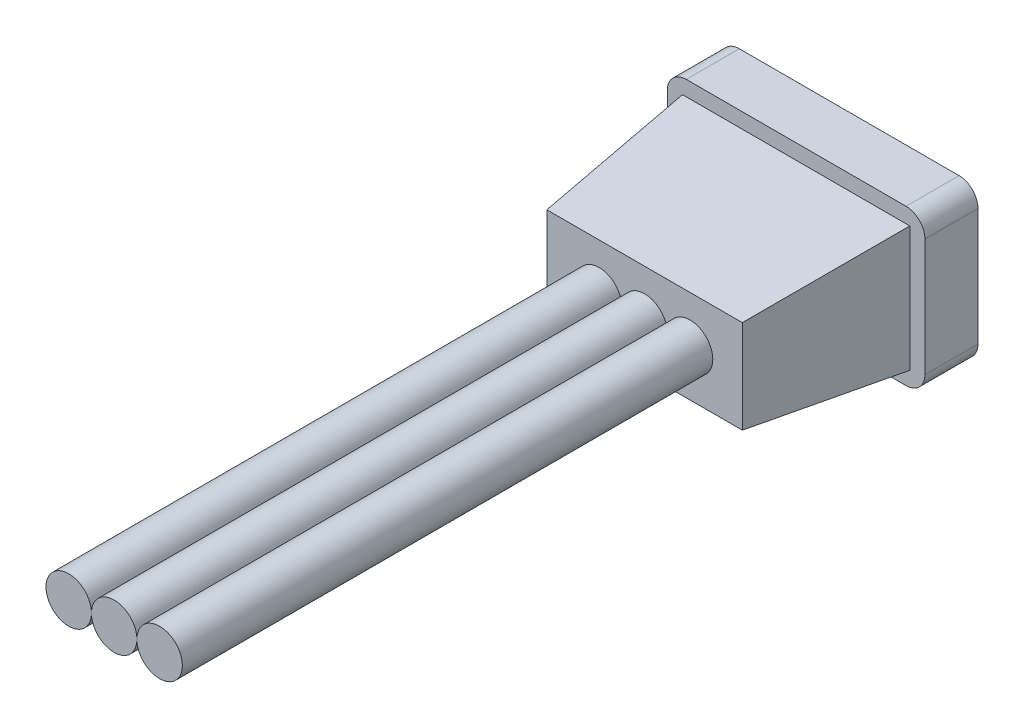
ISO-10303-21;
HEADER;
FILE_DESCRIPTION(('STEP AP214'),'2;1');
FILE_NAME('part.step','',(''),(''),'','','');
FILE_SCHEMA(('AUTOMOTIVE_DESIGN { 1 0 10303 214 1 1 1 1 }'));
ENDSEC;
DATA;
#1=APPLICATION_CONTEXT('core data for automotive mechanical design processes');
#2=APPLICATION_PROTOCOL_DEFINITION('international standard','automotive_design',2000,#1);
#3=PRODUCT_CONTEXT('',#1,'mechanical');
#4=PRODUCT('Part','Part','',(#3));
#5=PRODUCT_RELATED_PRODUCT_CATEGORY('part','',(#4));
#6=PRODUCT_DEFINITION_FORMATION('','',#4);
#7=PRODUCT_DEFINITION_CONTEXT('part definition',#1,'design');
#8=PRODUCT_DEFINITION('design','',#6,#7);
#9=PRODUCT_DEFINITION_SHAPE('','',#8);
#10=(LENGTH_UNIT() NAMED_UNIT(*) SI_UNIT(.MILLI.,.METRE.));
#11=(NAMED_UNIT(*) PLANE_ANGLE_UNIT() SI_UNIT($,.RADIAN.));
#12=(NAMED_UNIT(*) SI_UNIT($,.STERADIAN.) SOLID_ANGLE_UNIT());
#13=UNCERTAINTY_MEASURE_WITH_UNIT(LENGTH_MEASURE(1.E-05),#10,'distance_accuracy_value','');
#14=(GEOMETRIC_REPRESENTATION_CONTEXT(3) GLOBAL_UNCERTAINTY_ASSIGNED_CONTEXT((#13)) GLOBAL_UNIT_ASSIGNED_CONTEXT((#10,
#11,#12)) REPRESENTATION_CONTEXT('',''));
#15=CARTESIAN_POINT('',(0.,0.,0.));
#16=DIRECTION('',(0.,0.,1.));
#17=DIRECTION('',(1.,0.,0.));
#18=AXIS2_PLACEMENT_3D('',#15,#16,#17);
#19=CARTESIAN_POINT('',(-1.2,0.,21.0970562748477));
#20=DIRECTION('',(0.,0.,-1.));
#21=DIRECTION('',(-1.,0.,0.));
#22=AXIS2_PLACEMENT_3D('',#19,#20,#21);
#23=CYLINDRICAL_SURFACE('',#22,0.6);
#24=CARTESIAN_POINT('',(-1.2,0.,5.4));
#25=DIRECTION('',(0.,0.,1.));
#26=DIRECTION('',(1.,0.,0.));
#27=AXIS2_PLACEMENT_3D('',#24,#25,#26);
#28=CIRCLE('',#27,0.6);
#29=CARTESIAN_POINT('',(-0.6,0.,5.4));
#30=VERTEX_POINT('',#29);
#31=EDGE_CURVE('E46',#30,#30,#28,.T.);
#32=ORIENTED_EDGE('',*,*,#31,.T.);
#33=EDGE_LOOP('',(#32));
#34=FACE_BOUND('',#33,.T.);
#35=CARTESIAN_POINT('',(-1.2,0.,19.4));
#36=DIRECTION('',(0.,0.,1.));
#37=DIRECTION('',(1.,0.,0.));
#38=AXIS2_PLACEMENT_3D('',#35,#36,#37);
#39=CIRCLE('',#38,0.6);
#40=CARTESIAN_POINT('',(-0.6,0.,19.4));
#41=VERTEX_POINT('',#40);
#42=EDGE_CURVE('E11',#41,#41,#39,.T.);
#43=ORIENTED_EDGE('',*,*,#42,.F.);
#44=EDGE_LOOP('',(#43));
#45=FACE_BOUND('',#44,.T.);
#46=ADVANCED_FACE('F39',(#34,#45),#23,.T.);
#47=CARTESIAN_POINT('',(-1.2,0.,5.4));
#48=DIRECTION('',(0.,0.,1.));
#49=DIRECTION('',(1.,0.,0.));
#50=AXIS2_PLACEMENT_3D('',#47,#48,#49);
#51=PLANE('',#50);
#52=ORIENTED_EDGE('',*,*,#31,.F.);
#53=EDGE_LOOP('',(#52));
#54=FACE_BOUND('',#53,.T.);
#55=ADVANCED_FACE('F54',(#54),#51,.F.);
#56=CARTESIAN_POINT('',(0.,0.,19.4));
#57=DIRECTION('',(0.,0.,1.));
#58=DIRECTION('',(1.,0.,0.));
#59=AXIS2_PLACEMENT_3D('',#56,#57,#58);
#60=PLANE('',#59);
#61=ORIENTED_EDGE('',*,*,#42,.T.);
#62=EDGE_LOOP('',(#61));
#63=FACE_BOUND('',#62,.T.);
#64=ADVANCED_FACE('F41',(#63),#60,.T.);
#65=CLOSED_SHELL('',(#46,#55,#64));
#66=MANIFOLD_SOLID_BREP('B2',#65);
#67=CARTESIAN_POINT('',(1.2,0.,21.0970562748477));
#68=DIRECTION('',(0.,0.,-1.));
#69=DIRECTION('',(-1.,0.,0.));
#70=AXIS2_PLACEMENT_3D('',#67,#68,#69);
#71=CYLINDRICAL_SURFACE('',#70,0.6);
#72=CARTESIAN_POINT('',(1.2,0.,5.4));
#73=DIRECTION('',(0.,0.,1.));
#74=DIRECTION('',(1.,0.,0.));
#75=AXIS2_PLACEMENT_3D('',#72,#73,#74);
#76=CIRCLE('',#75,0.6);
#77=CARTESIAN_POINT('',(1.8,0.,5.4));
#78=VERTEX_POINT('',#77);
#79=EDGE_CURVE('E94',#78,#78,#76,.T.);
#80=ORIENTED_EDGE('',*,*,#79,.T.);
#81=EDGE_LOOP('',(#80));
#82=FACE_BOUND('',#81,.T.);
#83=CARTESIAN_POINT('',(1.2,0.,19.4));
#84=DIRECTION('',(0.,0.,1.));
#85=DIRECTION('',(1.,0.,0.));
#86=AXIS2_PLACEMENT_3D('',#83,#84,#85);
#87=CIRCLE('',#86,0.6);
#88=CARTESIAN_POINT('',(1.8,0.,19.4));
#89=VERTEX_POINT('',#88);
#90=EDGE_CURVE('E38',#89,#89,#87,.T.);
#91=ORIENTED_EDGE('',*,*,#90,.F.);
#92=EDGE_LOOP('',(#91));
#93=FACE_BOUND('',#92,.T.);
#94=ADVANCED_FACE('F87',(#82,#93),#71,.T.);
#95=CARTESIAN_POINT('',(1.2,0.,5.4));
#96=DIRECTION('',(0.,0.,1.));
#97=DIRECTION('',(1.,0.,0.));
#98=AXIS2_PLACEMENT_3D('',#95,#96,#97);
#99=PLANE('',#98);
#100=ORIENTED_EDGE('',*,*,#79,.F.);
#101=EDGE_LOOP('',(#100));
#102=FACE_BOUND('',#101,.T.);
#103=ADVANCED_FACE('F102',(#102),#99,.F.);
#104=CARTESIAN_POINT('',(0.,0.,19.4));
#105=DIRECTION('',(0.,0.,1.));
#106=DIRECTION('',(1.,0.,0.));
#107=AXIS2_PLACEMENT_3D('',#104,#105,#106);
#108=PLANE('',#107);
#109=ORIENTED_EDGE('',*,*,#90,.T.);
#110=EDGE_LOOP('',(#109));
#111=FACE_BOUND('',#110,.T.);
#112=ADVANCED_FACE('F89',(#111),#108,.T.);
#113=CLOSED_SHELL('',(#94,#103,#112));
#114=MANIFOLD_SOLID_BREP('B6',#113);
#115=CARTESIAN_POINT('',(0.,0.,19.4));
#116=DIRECTION('',(0.,0.,-1.));
#117=DIRECTION('',(-1.,0.,0.));
#118=AXIS2_PLACEMENT_3D('',#115,#116,#117);
#119=CYLINDRICAL_SURFACE('',#118,0.6);
#120=CARTESIAN_POINT('',(0.,0.,19.4));
#121=DIRECTION('',(0.,0.,1.));
#122=DIRECTION('',(1.,0.,0.));
#123=AXIS2_PLACEMENT_3D('',#120,#121,#122);
#124=CIRCLE('',#123,0.6);
#125=CARTESIAN_POINT('',(0.6,0.,19.4));
#126=VERTEX_POINT('',#125);
#127=EDGE_CURVE('E86',#126,#126,#124,.T.);
#128=ORIENTED_EDGE('',*,*,#127,.F.);
#129=EDGE_LOOP('',(#128));
#130=FACE_BOUND('',#129,.T.);
#131=CARTESIAN_POINT('',(0.,0.,5.4));
#132=DIRECTION('',(0.,0.,1.));
#133=DIRECTION('',(1.,0.,0.));
#134=AXIS2_PLACEMENT_3D('',#131,#132,#133);
#135=CIRCLE('',#134,0.6);
#136=CARTESIAN_POINT('',(0.6,0.,5.4));
#137=VERTEX_POINT('',#136);
#138=EDGE_CURVE('E139',#137,#137,#135,.T.);
#139=ORIENTED_EDGE('',*,*,#138,.T.);
#140=EDGE_LOOP('',(#139));
#141=FACE_BOUND('',#140,.T.);
#142=ADVANCED_FACE('F136',(#130,#141),#119,.T.);
#143=CARTESIAN_POINT('',(0.,0.,19.4));
#144=DIRECTION('',(0.,0.,1.));
#145=DIRECTION('',(1.,0.,0.));
#146=AXIS2_PLACEMENT_3D('',#143,#144,#145);
#147=PLANE('',#146);
#148=ORIENTED_EDGE('',*,*,#127,.T.);
#149=EDGE_LOOP('',(#148));
#150=FACE_BOUND('',#149,.T.);
#151=ADVANCED_FACE('F151',(#150),#147,.T.);
#152=CARTESIAN_POINT('',(0.,0.,5.4));
#153=DIRECTION('',(0.,0.,1.));
#154=DIRECTION('',(1.,0.,0.));
#155=AXIS2_PLACEMENT_3D('',#152,#153,#154);
#156=PLANE('',#155);
#157=ORIENTED_EDGE('',*,*,#138,.F.);
#158=EDGE_LOOP('',(#157));
#159=FACE_BOUND('',#158,.T.);
#160=ADVANCED_FACE('F149',(#159),#156,.F.);
#161=CLOSED_SHELL('',(#142,#151,#160));
#162=MANIFOLD_SOLID_BREP('B33',#161);
#163=CARTESIAN_POINT('',(0.,0.,1.4));
#164=DIRECTION('',(0.,0.,1.));
#165=DIRECTION('',(1.,0.,0.));
#166=AXIS2_PLACEMENT_3D('',#163,#164,#165);
#167=PLANE('',#166);
#168=DIRECTION('',(0.,-1.,0.));
#169=VECTOR('',#168,1.);
#170=CARTESIAN_POINT('',(-3.4,2.05,1.4));
#171=LINE('',#170,#169);
#172=CARTESIAN_POINT('',(-3.4,1.55,1.4));
#173=VERTEX_POINT('',#172);
#174=CARTESIAN_POINT('',(-3.4,-1.55,1.4));
#175=VERTEX_POINT('',#174);
#176=EDGE_CURVE('E313',#173,#175,#171,.T.);
#177=ORIENTED_EDGE('',*,*,#176,.T.);
#178=CARTESIAN_POINT('',(-2.9,-1.55,1.4));
#179=DIRECTION('',(0.,0.,1.));
#180=DIRECTION('',(1.,0.,0.));
#181=AXIS2_PLACEMENT_3D('',#178,#179,#180);
#182=CIRCLE('',#181,0.5);
#183=CARTESIAN_POINT('',(-2.9,-2.05,1.4));
#184=VERTEX_POINT('',#183);
#185=EDGE_CURVE('E351',#175,#184,#182,.T.);
#186=ORIENTED_EDGE('',*,*,#185,.T.);
#187=DIRECTION('',(1.,0.,0.));
#188=VECTOR('',#187,1.);
#189=CARTESIAN_POINT('',(-3.4,-2.05,1.4));
#190=LINE('',#189,#188);
#191=CARTESIAN_POINT('',(2.9,-2.05,1.4));
#192=VERTEX_POINT('',#191);
#193=EDGE_CURVE('E316',#184,#192,#190,.T.);
#194=ORIENTED_EDGE('',*,*,#193,.T.);
#195=CARTESIAN_POINT('',(2.9,-1.55,1.4));
#196=DIRECTION('',(0.,0.,1.));
#197=DIRECTION('',(1.,0.,0.));
#198=AXIS2_PLACEMENT_3D('',#195,#196,#197);
#199=CIRCLE('',#198,0.5);
#200=CARTESIAN_POINT('',(3.4,-1.55,1.4));
#201=VERTEX_POINT('',#200);
#202=EDGE_CURVE('E347',#192,#201,#199,.T.);
#203=ORIENTED_EDGE('',*,*,#202,.T.);
#204=DIRECTION('',(0.,1.,0.));
#205=VECTOR('',#204,1.);
#206=CARTESIAN_POINT('',(3.4,2.05,1.4));
#207=LINE('',#206,#205);
#208=CARTESIAN_POINT('',(3.4,1.55,1.4));
#209=VERTEX_POINT('',#208);
#210=EDGE_CURVE('E308',#201,#209,#207,.T.);
#211=ORIENTED_EDGE('',*,*,#210,.T.);
#212=CARTESIAN_POINT('',(2.9,1.55,1.4));
#213=DIRECTION('',(0.,0.,1.));
#214=DIRECTION('',(1.,0.,0.));
#215=AXIS2_PLACEMENT_3D('',#212,#213,#214);
#216=CIRCLE('',#215,0.5);
#217=CARTESIAN_POINT('',(2.9,2.05,1.4));
#218=VERTEX_POINT('',#217);
#219=EDGE_CURVE('E198',#209,#218,#216,.T.);
#220=ORIENTED_EDGE('',*,*,#219,.T.);
#221=DIRECTION('',(-1.,0.,0.));
#222=VECTOR('',#221,1.);
#223=CARTESIAN_POINT('',(-3.4,2.05,1.4));
#224=LINE('',#223,#222);
#225=CARTESIAN_POINT('',(-2.9,2.05,1.4));
#226=VERTEX_POINT('',#225);
#227=EDGE_CURVE('E310',#218,#226,#224,.T.);
#228=ORIENTED_EDGE('',*,*,#227,.T.);
#229=CARTESIAN_POINT('',(-2.9,1.55,1.4));
#230=DIRECTION('',(0.,0.,1.));
#231=DIRECTION('',(1.,0.,0.));
#232=AXIS2_PLACEMENT_3D('',#229,#230,#231);
#233=CIRCLE('',#232,0.5);
#234=EDGE_CURVE('E349',#226,#173,#233,.T.);
#235=ORIENTED_EDGE('',*,*,#234,.T.);
#236=EDGE_LOOP('',(#177,#186,#194,#203,#211,#220,#228,#235));
#237=FACE_BOUND('',#236,.T.);
#238=DIRECTION('',(-1.,0.,0.));
#239=VECTOR('',#238,1.);
#240=CARTESIAN_POINT('',(-3.,1.65,1.4));
#241=LINE('',#240,#239);
#242=CARTESIAN_POINT('',(3.,1.65,1.4));
#243=VERTEX_POINT('',#242);
#244=CARTESIAN_POINT('',(-3.,1.65,1.4));
#245=VERTEX_POINT('',#244);
#246=EDGE_CURVE('E271',#243,#245,#241,.T.);
#247=ORIENTED_EDGE('',*,*,#246,.F.);
#248=DIRECTION('',(0.,1.,0.));
#249=VECTOR('',#248,1.);
#250=CARTESIAN_POINT('',(3.,1.65,1.4));
#251=LINE('',#250,#249);
#252=CARTESIAN_POINT('',(3.,-1.65,1.4));
#253=VERTEX_POINT('',#252);
#254=EDGE_CURVE('E282',#253,#243,#251,.T.);
#255=ORIENTED_EDGE('',*,*,#254,.F.);
#256=DIRECTION('',(1.,0.,0.));
#257=VECTOR('',#256,1.);
#258=CARTESIAN_POINT('',(-3.,-1.65,1.4));
#259=LINE('',#258,#257);
#260=CARTESIAN_POINT('',(-3.,-1.65,1.4));
#261=VERTEX_POINT('',#260);
#262=EDGE_CURVE('E293',#261,#253,#259,.T.);
#263=ORIENTED_EDGE('',*,*,#262,.F.);
#264=DIRECTION('',(0.,-1.,0.));
#265=VECTOR('',#264,1.);
#266=CARTESIAN_POINT('',(-3.,1.65,1.4));
#267=LINE('',#266,#265);
#268=EDGE_CURVE('E291',#245,#261,#267,.T.);
#269=ORIENTED_EDGE('',*,*,#268,.F.);
#270=EDGE_LOOP('',(#247,#255,#263,#269));
#271=FACE_BOUND('',#270,.T.);
#272=ADVANCED_FACE('F176',(#237,#271),#167,.T.);
#273=CARTESIAN_POINT('',(3.4,2.05,1.4));
#274=DIRECTION('',(-1.,0.,0.));
#275=DIRECTION('',(0.,-1.,0.));
#276=AXIS2_PLACEMENT_3D('',#273,#274,#275);
#277=PLANE('',#276);
#278=ORIENTED_EDGE('',*,*,#210,.F.);
#279=DIRECTION('',(0.,0.,-1.));
#280=VECTOR('',#279,1.);
#281=CARTESIAN_POINT('',(3.4,-1.55,1.4));
#282=LINE('',#281,#280);
#283=CARTESIAN_POINT('',(3.4,-1.55,0.));
#284=VERTEX_POINT('',#283);
#285=EDGE_CURVE('E134',#201,#284,#282,.T.);
#286=ORIENTED_EDGE('',*,*,#285,.T.);
#287=DIRECTION('',(0.,1.,0.));
#288=VECTOR('',#287,1.);
#289=CARTESIAN_POINT('',(3.4,2.05,0.));
#290=LINE('',#289,#288);
#291=CARTESIAN_POINT('',(3.4,1.55,0.));
#292=VERTEX_POINT('',#291);
#293=EDGE_CURVE('E277',#284,#292,#290,.T.);
#294=ORIENTED_EDGE('',*,*,#293,.T.);
#295=DIRECTION('',(0.,0.,-1.));
#296=VECTOR('',#295,1.);
#297=CARTESIAN_POINT('',(3.4,1.55,1.4));
#298=LINE('',#297,#296);
#299=EDGE_CURVE('E184',#292,#209,#298,.F.);
#300=ORIENTED_EDGE('',*,*,#299,.T.);
#301=EDGE_LOOP('',(#278,#286,#294,#300));
#302=FACE_BOUND('',#301,.T.);
#303=ADVANCED_FACE('F359',(#302),#277,.F.);
#304=CARTESIAN_POINT('',(-3.4,2.05,1.4));
#305=DIRECTION('',(0.,-1.,0.));
#306=DIRECTION('',(0.,0.,-1.));
#307=AXIS2_PLACEMENT_3D('',#304,#305,#306);
#308=PLANE('',#307);
#309=DIRECTION('',(-1.,0.,0.));
#310=VECTOR('',#309,1.);
#311=CARTESIAN_POINT('',(-3.4,2.05,0.));
#312=LINE('',#311,#310);
#313=CARTESIAN_POINT('',(2.9,2.05,0.));
#314=VERTEX_POINT('',#313);
#315=CARTESIAN_POINT('',(-2.9,2.05,0.));
#316=VERTEX_POINT('',#315);
#317=EDGE_CURVE('E322',#314,#316,#312,.T.);
#318=ORIENTED_EDGE('',*,*,#317,.T.);
#319=DIRECTION('',(0.,0.,-1.));
#320=VECTOR('',#319,1.);
#321=CARTESIAN_POINT('',(-2.9,2.05,1.4));
#322=LINE('',#321,#320);
#323=EDGE_CURVE('E191',#316,#226,#322,.F.);
#324=ORIENTED_EDGE('',*,*,#323,.T.);
#325=ORIENTED_EDGE('',*,*,#227,.F.);
#326=DIRECTION('',(0.,0.,-1.));
#327=VECTOR('',#326,1.);
#328=CARTESIAN_POINT('',(2.9,2.05,1.4));
#329=LINE('',#328,#327);
#330=EDGE_CURVE('E353',#218,#314,#329,.T.);
#331=ORIENTED_EDGE('',*,*,#330,.T.);
#332=EDGE_LOOP('',(#318,#324,#325,#331));
#333=FACE_BOUND('',#332,.T.);
#334=ADVANCED_FACE('F366',(#333),#308,.F.);
#335=CARTESIAN_POINT('',(-3.4,2.05,1.4));
#336=DIRECTION('',(1.,0.,0.));
#337=DIRECTION('',(0.,1.,0.));
#338=AXIS2_PLACEMENT_3D('',#335,#336,#337);
#339=PLANE('',#338);
#340=DIRECTION('',(0.,-1.,0.));
#341=VECTOR('',#340,1.);
#342=CARTESIAN_POINT('',(-3.4,2.05,0.));
#343=LINE('',#342,#341);
#344=CARTESIAN_POINT('',(-3.4,1.55,0.));
#345=VERTEX_POINT('',#344);
#346=CARTESIAN_POINT('',(-3.4,-1.55,0.));
#347=VERTEX_POINT('',#346);
#348=EDGE_CURVE('E324',#345,#347,#343,.T.);
#349=ORIENTED_EDGE('',*,*,#348,.T.);
#350=DIRECTION('',(0.,0.,-1.));
#351=VECTOR('',#350,1.);
#352=CARTESIAN_POINT('',(-3.4,-1.55,1.4));
#353=LINE('',#352,#351);
#354=EDGE_CURVE('E344',#347,#175,#353,.F.);
#355=ORIENTED_EDGE('',*,*,#354,.T.);
#356=ORIENTED_EDGE('',*,*,#176,.F.);
#357=DIRECTION('',(0.,0.,-1.));
#358=VECTOR('',#357,1.);
#359=CARTESIAN_POINT('',(-3.4,1.55,1.4));
#360=LINE('',#359,#358);
#361=EDGE_CURVE('E341',#173,#345,#360,.T.);
#362=ORIENTED_EDGE('',*,*,#361,.T.);
#363=EDGE_LOOP('',(#349,#355,#356,#362));
#364=FACE_BOUND('',#363,.T.);
#365=ADVANCED_FACE('F377',(#364),#339,.F.);
#366=CARTESIAN_POINT('',(-3.4,-2.05,1.4));
#367=DIRECTION('',(0.,1.,0.));
#368=DIRECTION('',(0.,0.,1.));
#369=AXIS2_PLACEMENT_3D('',#366,#367,#368);
#370=PLANE('',#369);
#371=ORIENTED_EDGE('',*,*,#193,.F.);
#372=DIRECTION('',(0.,0.,-1.));
#373=VECTOR('',#372,1.);
#374=CARTESIAN_POINT('',(-2.9,-2.05,1.4));
#375=LINE('',#374,#373);
#376=CARTESIAN_POINT('',(-2.9,-2.05,0.));
#377=VERTEX_POINT('',#376);
#378=EDGE_CURVE('E330',#184,#377,#375,.T.);
#379=ORIENTED_EDGE('',*,*,#378,.T.);
#380=DIRECTION('',(1.,0.,0.));
#381=VECTOR('',#380,1.);
#382=CARTESIAN_POINT('',(-3.4,-2.05,0.));
#383=LINE('',#382,#381);
#384=CARTESIAN_POINT('',(2.9,-2.05,0.));
#385=VERTEX_POINT('',#384);
#386=EDGE_CURVE('E311',#377,#385,#383,.T.);
#387=ORIENTED_EDGE('',*,*,#386,.T.);
#388=DIRECTION('',(0.,0.,-1.));
#389=VECTOR('',#388,1.);
#390=CARTESIAN_POINT('',(2.9,-2.05,1.4));
#391=LINE('',#390,#389);
#392=EDGE_CURVE('E319',#385,#192,#391,.F.);
#393=ORIENTED_EDGE('',*,*,#392,.T.);
#394=EDGE_LOOP('',(#371,#379,#387,#393));
#395=FACE_BOUND('',#394,.T.);
#396=ADVANCED_FACE('F385',(#395),#370,.F.);
#397=CARTESIAN_POINT('',(0.,0.,0.));
#398=DIRECTION('',(0.,0.,1.));
#399=DIRECTION('',(1.,0.,0.));
#400=AXIS2_PLACEMENT_3D('',#397,#398,#399);
#401=PLANE('',#400);
#402=ORIENTED_EDGE('',*,*,#386,.F.);
#403=CARTESIAN_POINT('',(-2.9,-1.55,0.));
#404=DIRECTION('',(0.,0.,1.));
#405=DIRECTION('',(1.,0.,0.));
#406=AXIS2_PLACEMENT_3D('',#403,#404,#405);
#407=CIRCLE('',#406,0.5);
#408=EDGE_CURVE('E339',#377,#347,#407,.F.);
#409=ORIENTED_EDGE('',*,*,#408,.T.);
#410=ORIENTED_EDGE('',*,*,#348,.F.);
#411=CARTESIAN_POINT('',(-2.9,1.55,0.));
#412=DIRECTION('',(0.,0.,1.));
#413=DIRECTION('',(1.,0.,0.));
#414=AXIS2_PLACEMENT_3D('',#411,#412,#413);
#415=CIRCLE('',#414,0.5);
#416=EDGE_CURVE('E337',#345,#316,#415,.F.);
#417=ORIENTED_EDGE('',*,*,#416,.T.);
#418=ORIENTED_EDGE('',*,*,#317,.F.);
#419=CARTESIAN_POINT('',(2.9,1.55,0.));
#420=DIRECTION('',(0.,0.,1.));
#421=DIRECTION('',(1.,0.,0.));
#422=AXIS2_PLACEMENT_3D('',#419,#420,#421);
#423=CIRCLE('',#422,0.5);
#424=EDGE_CURVE('E333',#314,#292,#423,.F.);
#425=ORIENTED_EDGE('',*,*,#424,.T.);
#426=ORIENTED_EDGE('',*,*,#293,.F.);
#427=CARTESIAN_POINT('',(2.9,-1.55,0.));
#428=DIRECTION('',(0.,0.,1.));
#429=DIRECTION('',(1.,0.,0.));
#430=AXIS2_PLACEMENT_3D('',#427,#428,#429);
#431=CIRCLE('',#430,0.5);
#432=EDGE_CURVE('E335',#284,#385,#431,.F.);
#433=ORIENTED_EDGE('',*,*,#432,.T.);
#434=EDGE_LOOP('',(#402,#409,#410,#417,#418,#425,#426,#433));
#435=FACE_BOUND('',#434,.T.);
#436=ADVANCED_FACE('F369',(#435),#401,.F.);
#437=CARTESIAN_POINT('',(3.,1.65,1.4));
#438=DIRECTION('',(0.994521895368273,0.,0.104528463267654));
#439=DIRECTION('',(0.104528463267654,0.,-0.994521895368273));
#440=AXIS2_PLACEMENT_3D('',#437,#438,#439);
#441=PLANE('',#440);
#442=ORIENTED_EDGE('',*,*,#254,.T.);
#443=DIRECTION('',(0.103962051184498,0.103962051184498,-0.989132844377854));
#444=VECTOR('',#443,1.);
#445=CARTESIAN_POINT('',(2.93515135148107,1.58515135148107,2.01699367637287));
#446=LINE('',#445,#444);
#447=CARTESIAN_POINT('',(2.57958305893729,1.22958305893729,5.4));
#448=VERTEX_POINT('',#447);
#449=EDGE_CURVE('E266',#448,#243,#446,.T.);
#450=ORIENTED_EDGE('',*,*,#449,.F.);
#451=DIRECTION('',(0.,-1.,0.));
#452=VECTOR('',#451,1.);
#453=CARTESIAN_POINT('',(2.57958305893729,1.65,5.4));
#454=LINE('',#453,#452);
#455=CARTESIAN_POINT('',(2.57958305893729,-1.22958305893729,5.4));
#456=VERTEX_POINT('',#455);
#457=EDGE_CURVE('E296',#456,#448,#454,.F.);
#458=ORIENTED_EDGE('',*,*,#457,.F.);
#459=DIRECTION('',(0.103962051184498,-0.103962051184498,-0.989132844377854));
#460=VECTOR('',#459,1.);
#461=CARTESIAN_POINT('',(2.96433324331459,-1.61433324331459,1.73934652200508));
#462=LINE('',#461,#460);
#463=EDGE_CURVE('E285',#456,#253,#462,.T.);
#464=ORIENTED_EDGE('',*,*,#463,.T.);
#465=EDGE_LOOP('',(#442,#450,#458,#464));
#466=FACE_BOUND('',#465,.T.);
#467=ADVANCED_FACE('F283',(#466),#441,.T.);
#468=CARTESIAN_POINT('',(-3.,1.65,1.4));
#469=DIRECTION('',(0.,0.994521895368273,0.104528463267654));
#470=DIRECTION('',(0.,-0.104528463267654,0.994521895368273));
#471=AXIS2_PLACEMENT_3D('',#468,#469,#470);
#472=PLANE('',#471);
#473=ORIENTED_EDGE('',*,*,#246,.T.);
#474=DIRECTION('',(-0.103962051184498,0.103962051184498,-0.989132844377854));
#475=VECTOR('',#474,1.);
#476=CARTESIAN_POINT('',(-3.,1.65,1.4));
#477=LINE('',#476,#475);
#478=CARTESIAN_POINT('',(-2.57958305893729,1.22958305893729,5.4));
#479=VERTEX_POINT('',#478);
#480=EDGE_CURVE('E278',#479,#245,#477,.T.);
#481=ORIENTED_EDGE('',*,*,#480,.F.);
#482=DIRECTION('',(1.,0.,0.));
#483=VECTOR('',#482,1.);
#484=CARTESIAN_POINT('',(-3.,1.22958305893729,5.4));
#485=LINE('',#484,#483);
#486=EDGE_CURVE('E273',#448,#479,#485,.F.);
#487=ORIENTED_EDGE('',*,*,#486,.F.);
#488=ORIENTED_EDGE('',*,*,#449,.T.);
#489=EDGE_LOOP('',(#473,#481,#487,#488));
#490=FACE_BOUND('',#489,.T.);
#491=ADVANCED_FACE('F268',(#490),#472,.T.);
#492=CARTESIAN_POINT('',(-3.,1.65,1.4));
#493=DIRECTION('',(-0.994521895368273,0.,0.104528463267654));
#494=DIRECTION('',(0.104528463267654,0.,0.994521895368273));
#495=AXIS2_PLACEMENT_3D('',#492,#493,#494);
#496=PLANE('',#495);
#497=ORIENTED_EDGE('',*,*,#268,.T.);
#498=DIRECTION('',(-0.103962051184498,-0.103962051184498,-0.989132844377854));
#499=VECTOR('',#498,1.);
#500=CARTESIAN_POINT('',(-3.,-1.65,1.4));
#501=LINE('',#500,#499);
#502=CARTESIAN_POINT('',(-2.57958305893729,-1.22958305893729,5.4));
#503=VERTEX_POINT('',#502);
#504=EDGE_CURVE('E299',#503,#261,#501,.T.);
#505=ORIENTED_EDGE('',*,*,#504,.F.);
#506=DIRECTION('',(0.,1.,0.));
#507=VECTOR('',#506,1.);
#508=CARTESIAN_POINT('',(-2.57958305893729,1.65,5.4));
#509=LINE('',#508,#507);
#510=EDGE_CURVE('E305',#479,#503,#509,.F.);
#511=ORIENTED_EDGE('',*,*,#510,.F.);
#512=ORIENTED_EDGE('',*,*,#480,.T.);
#513=EDGE_LOOP('',(#497,#505,#511,#512));
#514=FACE_BOUND('',#513,.T.);
#515=ADVANCED_FACE('F423',(#514),#496,.T.);
#516=CARTESIAN_POINT('',(-3.,-1.65,1.4));
#517=DIRECTION('',(0.,-0.994521895368273,0.104528463267654));
#518=DIRECTION('',(0.,-0.104528463267654,-0.994521895368273));
#519=AXIS2_PLACEMENT_3D('',#516,#517,#518);
#520=PLANE('',#519);
#521=ORIENTED_EDGE('',*,*,#262,.T.);
#522=ORIENTED_EDGE('',*,*,#463,.F.);
#523=DIRECTION('',(-1.,0.,0.));
#524=VECTOR('',#523,1.);
#525=CARTESIAN_POINT('',(-3.,-1.22958305893729,5.4));
#526=LINE('',#525,#524);
#527=EDGE_CURVE('E300',#503,#456,#526,.F.);
#528=ORIENTED_EDGE('',*,*,#527,.F.);
#529=ORIENTED_EDGE('',*,*,#504,.T.);
#530=EDGE_LOOP('',(#521,#522,#528,#529));
#531=FACE_BOUND('',#530,.T.);
#532=ADVANCED_FACE('F417',(#531),#520,.T.);
#533=CARTESIAN_POINT('',(0.,0.,5.4));
#534=DIRECTION('',(0.,0.,1.));
#535=DIRECTION('',(1.,0.,0.));
#536=AXIS2_PLACEMENT_3D('',#533,#534,#535);
#537=PLANE('',#536);
#538=ORIENTED_EDGE('',*,*,#457,.T.);
#539=ORIENTED_EDGE('',*,*,#486,.T.);
#540=ORIENTED_EDGE('',*,*,#510,.T.);
#541=ORIENTED_EDGE('',*,*,#527,.T.);
#542=EDGE_LOOP('',(#538,#539,#540,#541));
#543=FACE_BOUND('',#542,.T.);
#544=ADVANCED_FACE('F413',(#543),#537,.T.);
#545=CARTESIAN_POINT('',(-2.9,-1.55,1.4));
#546=DIRECTION('',(0.,0.,-1.));
#547=DIRECTION('',(-1.,0.,0.));
#548=AXIS2_PLACEMENT_3D('',#545,#546,#547);
#549=CYLINDRICAL_SURFACE('',#548,0.5);
#550=ORIENTED_EDGE('',*,*,#185,.F.);
#551=ORIENTED_EDGE('',*,*,#354,.F.);
#552=ORIENTED_EDGE('',*,*,#408,.F.);
#553=ORIENTED_EDGE('',*,*,#378,.F.);
#554=EDGE_LOOP('',(#550,#551,#552,#553));
#555=FACE_BOUND('',#554,.T.);
#556=ADVANCED_FACE('F383',(#555),#549,.T.);
#557=CARTESIAN_POINT('',(-2.9,1.55,1.4));
#558=DIRECTION('',(0.,0.,-1.));
#559=DIRECTION('',(-1.,0.,0.));
#560=AXIS2_PLACEMENT_3D('',#557,#558,#559);
#561=CYLINDRICAL_SURFACE('',#560,0.5);
#562=ORIENTED_EDGE('',*,*,#234,.F.);
#563=ORIENTED_EDGE('',*,*,#323,.F.);
#564=ORIENTED_EDGE('',*,*,#416,.F.);
#565=ORIENTED_EDGE('',*,*,#361,.F.);
#566=EDGE_LOOP('',(#562,#563,#564,#565));
#567=FACE_BOUND('',#566,.T.);
#568=ADVANCED_FACE('F374',(#567),#561,.T.);
#569=CARTESIAN_POINT('',(2.9,-1.55,1.4));
#570=DIRECTION('',(0.,0.,-1.));
#571=DIRECTION('',(-1.,0.,0.));
#572=AXIS2_PLACEMENT_3D('',#569,#570,#571);
#573=CYLINDRICAL_SURFACE('',#572,0.5);
#574=ORIENTED_EDGE('',*,*,#202,.F.);
#575=ORIENTED_EDGE('',*,*,#392,.F.);
#576=ORIENTED_EDGE('',*,*,#432,.F.);
#577=ORIENTED_EDGE('',*,*,#285,.F.);
#578=EDGE_LOOP('',(#574,#575,#576,#577));
#579=FACE_BOUND('',#578,.T.);
#580=ADVANCED_FACE('F388',(#579),#573,.T.);
#581=CARTESIAN_POINT('',(2.9,1.55,1.4));
#582=DIRECTION('',(0.,0.,-1.));
#583=DIRECTION('',(-1.,0.,0.));
#584=AXIS2_PLACEMENT_3D('',#581,#582,#583);
#585=CYLINDRICAL_SURFACE('',#584,0.5);
#586=ORIENTED_EDGE('',*,*,#219,.F.);
#587=ORIENTED_EDGE('',*,*,#299,.F.);
#588=ORIENTED_EDGE('',*,*,#424,.F.);
#589=ORIENTED_EDGE('',*,*,#330,.F.);
#590=EDGE_LOOP('',(#586,#587,#588,#589));
#591=FACE_BOUND('',#590,.T.);
#592=ADVANCED_FACE('F178',(#591),#585,.T.);
#593=CLOSED_SHELL('',(#272,#303,#334,#365,#396,#436,#467,#491,#515,#532,#544,#556,#568,#580,#592));
#594=MANIFOLD_SOLID_BREP('B81',#593);
#595=ADVANCED_BREP_SHAPE_REPRESENTATION('',(#18,#66,#114,#162,#594),#14);
#596=SHAPE_DEFINITION_REPRESENTATION(#9,#595);
ENDSEC;
END-ISO-10303-21;
